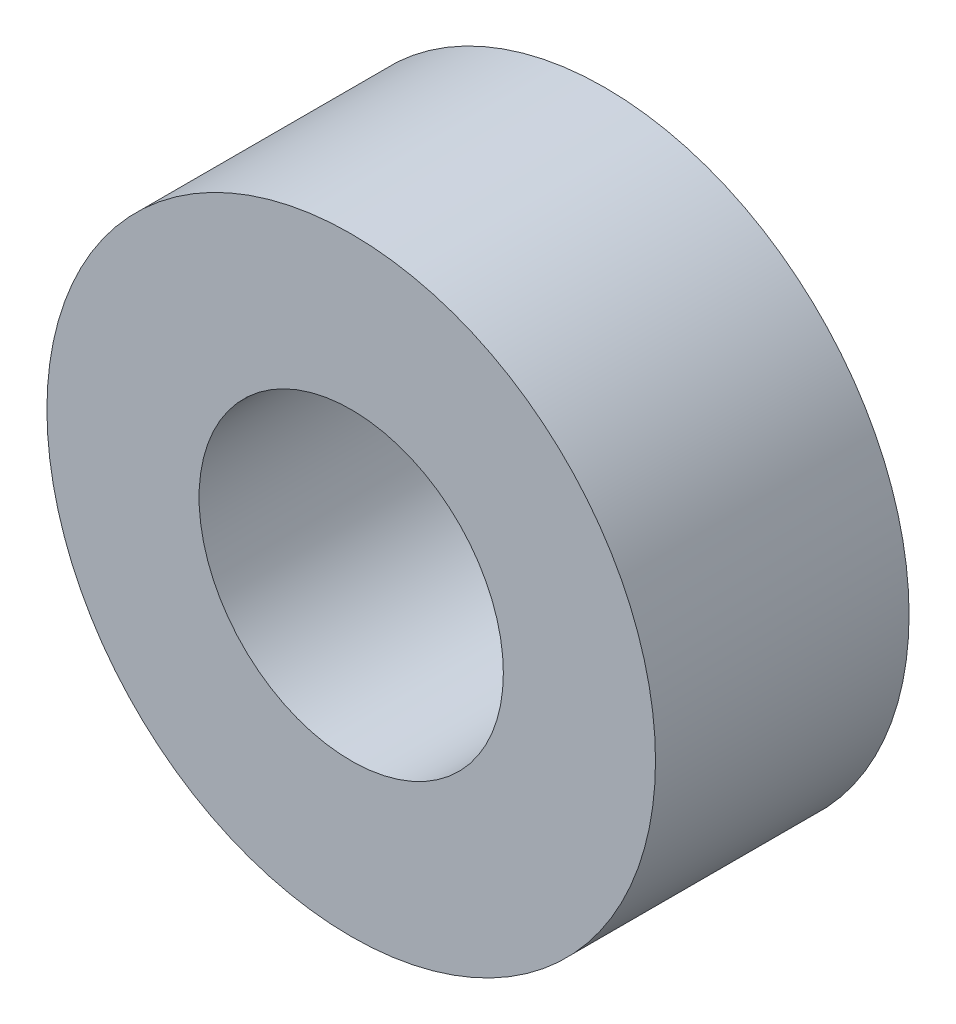
ISO-10303-21;
HEADER;
FILE_DESCRIPTION(('STEP AP214'),'2;1');
FILE_NAME('part.step','',(''),(''),'','','');
FILE_SCHEMA(('AUTOMOTIVE_DESIGN { 1 0 10303 214 1 1 1 1 }'));
ENDSEC;
DATA;
#1=APPLICATION_CONTEXT('core data for automotive mechanical design processes');
#2=APPLICATION_PROTOCOL_DEFINITION('international standard','automotive_design',2000,#1);
#3=PRODUCT_CONTEXT('',#1,'mechanical');
#4=PRODUCT('Part','Part','',(#3));
#5=PRODUCT_RELATED_PRODUCT_CATEGORY('part','',(#4));
#6=PRODUCT_DEFINITION_FORMATION('','',#4);
#7=PRODUCT_DEFINITION_CONTEXT('part definition',#1,'design');
#8=PRODUCT_DEFINITION('design','',#6,#7);
#9=PRODUCT_DEFINITION_SHAPE('','',#8);
#10=(LENGTH_UNIT() NAMED_UNIT(*) SI_UNIT(.MILLI.,.METRE.));
#11=(NAMED_UNIT(*) PLANE_ANGLE_UNIT() SI_UNIT($,.RADIAN.));
#12=(NAMED_UNIT(*) SI_UNIT($,.STERADIAN.) SOLID_ANGLE_UNIT());
#13=UNCERTAINTY_MEASURE_WITH_UNIT(LENGTH_MEASURE(1.E-05),#10,'distance_accuracy_value','');
#14=(GEOMETRIC_REPRESENTATION_CONTEXT(3) GLOBAL_UNCERTAINTY_ASSIGNED_CONTEXT((#13)) GLOBAL_UNIT_ASSIGNED_CONTEXT((#10,
#11,#12)) REPRESENTATION_CONTEXT('',''));
#15=CARTESIAN_POINT('',(0.,0.,0.));
#16=DIRECTION('',(0.,0.,1.));
#17=DIRECTION('',(1.,0.,0.));
#18=AXIS2_PLACEMENT_3D('',#15,#16,#17);
#19=CARTESIAN_POINT('',(0.,0.,2.5));
#20=DIRECTION('',(0.,0.,1.));
#21=DIRECTION('',(1.,0.,0.));
#22=AXIS2_PLACEMENT_3D('',#19,#20,#21);
#23=PLANE('',#22);
#24=CARTESIAN_POINT('',(0.,0.,2.5));
#25=DIRECTION('',(0.,0.,1.));
#26=DIRECTION('',(1.,0.,0.));
#27=AXIS2_PLACEMENT_3D('',#24,#25,#26);
#28=CIRCLE('',#27,3.);
#29=CARTESIAN_POINT('',(3.,0.,2.5));
#30=VERTEX_POINT('',#29);
#31=EDGE_CURVE('E10',#30,#30,#28,.T.);
#32=ORIENTED_EDGE('',*,*,#31,.T.);
#33=EDGE_LOOP('',(#32));
#34=FACE_BOUND('',#33,.T.);
#35=CARTESIAN_POINT('',(0.,0.,2.5));
#36=DIRECTION('',(0.,0.,1.));
#37=DIRECTION('',(1.,0.,0.));
#38=AXIS2_PLACEMENT_3D('',#35,#36,#37);
#39=CIRCLE('',#38,1.5);
#40=CARTESIAN_POINT('',(1.5,0.,2.5));
#41=VERTEX_POINT('',#40);
#42=EDGE_CURVE('E42',#41,#41,#39,.T.);
#43=ORIENTED_EDGE('',*,*,#42,.F.);
#44=EDGE_LOOP('',(#43));
#45=FACE_BOUND('',#44,.T.);
#46=ADVANCED_FACE('F31',(#34,#45),#23,.T.);
#47=CARTESIAN_POINT('',(0.,0.,0.));
#48=DIRECTION('',(0.,0.,1.));
#49=DIRECTION('',(1.,0.,0.));
#50=AXIS2_PLACEMENT_3D('',#47,#48,#49);
#51=PLANE('',#50);
#52=CARTESIAN_POINT('',(0.,0.,0.));
#53=DIRECTION('',(0.,0.,1.));
#54=DIRECTION('',(1.,0.,0.));
#55=AXIS2_PLACEMENT_3D('',#52,#53,#54);
#56=CIRCLE('',#55,3.);
#57=CARTESIAN_POINT('',(3.,0.,0.));
#58=VERTEX_POINT('',#57);
#59=EDGE_CURVE('E35',#58,#58,#56,.T.);
#60=ORIENTED_EDGE('',*,*,#59,.F.);
#61=EDGE_LOOP('',(#60));
#62=FACE_BOUND('',#61,.T.);
#63=CARTESIAN_POINT('',(0.,0.,0.));
#64=DIRECTION('',(0.,0.,1.));
#65=DIRECTION('',(1.,0.,0.));
#66=AXIS2_PLACEMENT_3D('',#63,#64,#65);
#67=CIRCLE('',#66,1.5);
#68=CARTESIAN_POINT('',(1.5,0.,0.));
#69=VERTEX_POINT('',#68);
#70=EDGE_CURVE('E44',#69,#69,#67,.T.);
#71=ORIENTED_EDGE('',*,*,#70,.T.);
#72=EDGE_LOOP('',(#71));
#73=FACE_BOUND('',#72,.T.);
#74=ADVANCED_FACE('F54',(#62,#73),#51,.F.);
#75=CARTESIAN_POINT('',(0.,0.,2.5));
#76=DIRECTION('',(0.,0.,-1.));
#77=DIRECTION('',(-1.,0.,0.));
#78=AXIS2_PLACEMENT_3D('',#75,#76,#77);
#79=CYLINDRICAL_SURFACE('',#78,3.);
#80=ORIENTED_EDGE('',*,*,#31,.F.);
#81=EDGE_LOOP('',(#80));
#82=FACE_BOUND('',#81,.T.);
#83=ORIENTED_EDGE('',*,*,#59,.T.);
#84=EDGE_LOOP('',(#83));
#85=FACE_BOUND('',#84,.T.);
#86=ADVANCED_FACE('F33',(#82,#85),#79,.T.);
#87=CARTESIAN_POINT('',(0.,0.,2.5));
#88=DIRECTION('',(0.,0.,-1.));
#89=DIRECTION('',(-1.,0.,0.));
#90=AXIS2_PLACEMENT_3D('',#87,#88,#89);
#91=CYLINDRICAL_SURFACE('',#90,1.5);
#92=ORIENTED_EDGE('',*,*,#42,.T.);
#93=EDGE_LOOP('',(#92));
#94=FACE_BOUND('',#93,.T.);
#95=ORIENTED_EDGE('',*,*,#70,.F.);
#96=EDGE_LOOP('',(#95));
#97=FACE_BOUND('',#96,.T.);
#98=ADVANCED_FACE('F50',(#94,#97),#91,.F.);
#99=CLOSED_SHELL('',(#46,#74,#86,#98));
#100=MANIFOLD_SOLID_BREP('B2',#99);
#101=ADVANCED_BREP_SHAPE_REPRESENTATION('',(#18,#100),#14);
#102=SHAPE_DEFINITION_REPRESENTATION(#9,#101);
ENDSEC;
END-ISO-10303-21;
